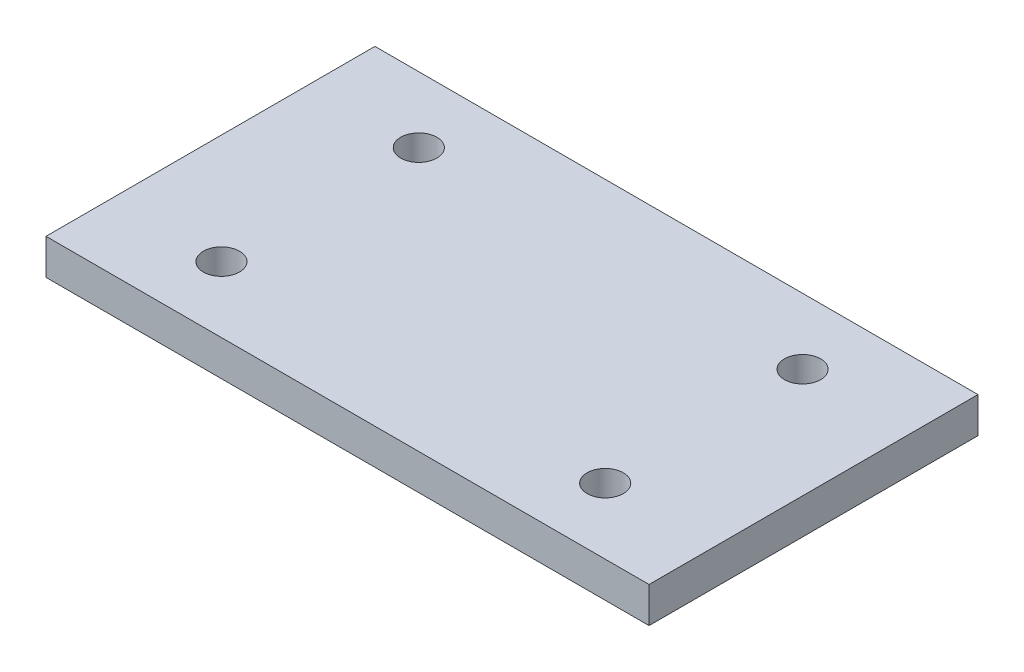
ISO-10303-21;
HEADER;
FILE_DESCRIPTION(('STEP AP214'),'2;1');
FILE_NAME('part.step','',(''),(''),'','','');
FILE_SCHEMA(('AUTOMOTIVE_DESIGN { 1 0 10303 214 1 1 1 1 }'));
ENDSEC;
DATA;
#1=APPLICATION_CONTEXT('core data for automotive mechanical design processes');
#2=APPLICATION_PROTOCOL_DEFINITION('international standard','automotive_design',2000,#1);
#3=PRODUCT_CONTEXT('',#1,'mechanical');
#4=PRODUCT('Part','Part','',(#3));
#5=PRODUCT_RELATED_PRODUCT_CATEGORY('part','',(#4));
#6=PRODUCT_DEFINITION_FORMATION('','',#4);
#7=PRODUCT_DEFINITION_CONTEXT('part definition',#1,'design');
#8=PRODUCT_DEFINITION('design','',#6,#7);
#9=PRODUCT_DEFINITION_SHAPE('','',#8);
#10=(LENGTH_UNIT() NAMED_UNIT(*) SI_UNIT(.MILLI.,.METRE.));
#11=(NAMED_UNIT(*) PLANE_ANGLE_UNIT() SI_UNIT($,.RADIAN.));
#12=(NAMED_UNIT(*) SI_UNIT($,.STERADIAN.) SOLID_ANGLE_UNIT());
#13=UNCERTAINTY_MEASURE_WITH_UNIT(LENGTH_MEASURE(1.E-05),#10,'distance_accuracy_value','');
#14=(GEOMETRIC_REPRESENTATION_CONTEXT(3) GLOBAL_UNCERTAINTY_ASSIGNED_CONTEXT((#13)) GLOBAL_UNIT_ASSIGNED_CONTEXT((#10,
#11,#12)) REPRESENTATION_CONTEXT('',''));
#15=CARTESIAN_POINT('',(0.,0.,0.));
#16=DIRECTION('',(0.,0.,1.));
#17=DIRECTION('',(1.,0.,0.));
#18=AXIS2_PLACEMENT_3D('',#15,#16,#17);
#19=CARTESIAN_POINT('',(0.,3.25,0.));
#20=DIRECTION('',(0.,-1.,0.));
#21=DIRECTION('',(0.,0.,-1.));
#22=AXIS2_PLACEMENT_3D('',#19,#20,#21);
#23=PLANE('',#22);
#24=DIRECTION('',(0.,0.,-1.));
#25=VECTOR('',#24,1.);
#26=CARTESIAN_POINT('',(27.5,3.25,15.));
#27=LINE('',#26,#25);
#28=CARTESIAN_POINT('',(27.5,3.25,15.));
#29=VERTEX_POINT('',#28);
#30=CARTESIAN_POINT('',(27.5,3.25,-15.));
#31=VERTEX_POINT('',#30);
#32=EDGE_CURVE('E96',#29,#31,#27,.T.);
#33=ORIENTED_EDGE('',*,*,#32,.T.);
#34=DIRECTION('',(-1.,0.,0.));
#35=VECTOR('',#34,1.);
#36=CARTESIAN_POINT('',(-27.5,3.25,-15.));
#37=LINE('',#36,#35);
#38=CARTESIAN_POINT('',(-27.5,3.25,-15.));
#39=VERTEX_POINT('',#38);
#40=EDGE_CURVE('E91',#31,#39,#37,.T.);
#41=ORIENTED_EDGE('',*,*,#40,.T.);
#42=DIRECTION('',(0.,0.,1.));
#43=VECTOR('',#42,1.);
#44=CARTESIAN_POINT('',(-27.5,3.25,15.));
#45=LINE('',#44,#43);
#46=CARTESIAN_POINT('',(-27.5,3.25,15.));
#47=VERTEX_POINT('',#46);
#48=EDGE_CURVE('E94',#39,#47,#45,.T.);
#49=ORIENTED_EDGE('',*,*,#48,.T.);
#50=DIRECTION('',(1.,0.,0.));
#51=VECTOR('',#50,1.);
#52=CARTESIAN_POINT('',(-27.5,3.25,15.));
#53=LINE('',#52,#51);
#54=EDGE_CURVE('E61',#47,#29,#53,.T.);
#55=ORIENTED_EDGE('',*,*,#54,.T.);
#56=EDGE_LOOP('',(#33,#41,#49,#55));
#57=FACE_BOUND('',#56,.T.);
#58=CARTESIAN_POINT('',(-17.5,3.25,-9.));
#59=DIRECTION('',(0.,1.,0.));
#60=DIRECTION('',(0.,0.,1.));
#61=AXIS2_PLACEMENT_3D('',#58,#59,#60);
#62=CIRCLE('',#61,1.65);
#63=CARTESIAN_POINT('',(-17.5,3.25,-7.35));
#64=VERTEX_POINT('',#63);
#65=EDGE_CURVE('E114',#64,#64,#62,.T.);
#66=ORIENTED_EDGE('',*,*,#65,.F.);
#67=EDGE_LOOP('',(#66));
#68=FACE_BOUND('',#67,.T.);
#69=CARTESIAN_POINT('',(17.5,3.25,-9.));
#70=DIRECTION('',(0.,1.,0.));
#71=DIRECTION('',(0.,0.,1.));
#72=AXIS2_PLACEMENT_3D('',#69,#70,#71);
#73=CIRCLE('',#72,1.65);
#74=CARTESIAN_POINT('',(17.5,3.25,-7.35));
#75=VERTEX_POINT('',#74);
#76=EDGE_CURVE('E134',#75,#75,#73,.T.);
#77=ORIENTED_EDGE('',*,*,#76,.F.);
#78=EDGE_LOOP('',(#77));
#79=FACE_BOUND('',#78,.T.);
#80=CARTESIAN_POINT('',(17.5,3.25,9.));
#81=DIRECTION('',(0.,1.,0.));
#82=DIRECTION('',(0.,0.,1.));
#83=AXIS2_PLACEMENT_3D('',#80,#81,#82);
#84=CIRCLE('',#83,1.65);
#85=CARTESIAN_POINT('',(17.5,3.25,10.65));
#86=VERTEX_POINT('',#85);
#87=EDGE_CURVE('E142',#86,#86,#84,.T.);
#88=ORIENTED_EDGE('',*,*,#87,.F.);
#89=EDGE_LOOP('',(#88));
#90=FACE_BOUND('',#89,.T.);
#91=CARTESIAN_POINT('',(-17.5,3.25,9.));
#92=DIRECTION('',(0.,1.,0.));
#93=DIRECTION('',(0.,0.,1.));
#94=AXIS2_PLACEMENT_3D('',#91,#92,#93);
#95=CIRCLE('',#94,1.65);
#96=CARTESIAN_POINT('',(-17.5,3.25,10.65));
#97=VERTEX_POINT('',#96);
#98=EDGE_CURVE('E149',#97,#97,#95,.T.);
#99=ORIENTED_EDGE('',*,*,#98,.F.);
#100=EDGE_LOOP('',(#99));
#101=FACE_BOUND('',#100,.T.);
#102=ADVANCED_FACE('F42',(#57,#68,#79,#90,#101),#23,.F.);
#103=CARTESIAN_POINT('',(0.,0.,0.));
#104=DIRECTION('',(0.,-1.,0.));
#105=DIRECTION('',(0.,0.,-1.));
#106=AXIS2_PLACEMENT_3D('',#103,#104,#105);
#107=PLANE('',#106);
#108=CARTESIAN_POINT('',(17.5,0.,9.));
#109=DIRECTION('',(0.,1.,0.));
#110=DIRECTION('',(0.,0.,1.));
#111=AXIS2_PLACEMENT_3D('',#108,#109,#110);
#112=CIRCLE('',#111,1.65);
#113=CARTESIAN_POINT('',(17.5,0.,10.65));
#114=VERTEX_POINT('',#113);
#115=EDGE_CURVE('E145',#114,#114,#112,.T.);
#116=ORIENTED_EDGE('',*,*,#115,.T.);
#117=EDGE_LOOP('',(#116));
#118=FACE_BOUND('',#117,.T.);
#119=CARTESIAN_POINT('',(-17.5,0.,-9.));
#120=DIRECTION('',(0.,1.,0.));
#121=DIRECTION('',(0.,0.,1.));
#122=AXIS2_PLACEMENT_3D('',#119,#120,#121);
#123=CIRCLE('',#122,1.65);
#124=CARTESIAN_POINT('',(-17.5,0.,-7.35));
#125=VERTEX_POINT('',#124);
#126=EDGE_CURVE('E130',#125,#125,#123,.T.);
#127=ORIENTED_EDGE('',*,*,#126,.T.);
#128=EDGE_LOOP('',(#127));
#129=FACE_BOUND('',#128,.T.);
#130=DIRECTION('',(0.,0.,-1.));
#131=VECTOR('',#130,1.);
#132=CARTESIAN_POINT('',(27.5,0.,15.));
#133=LINE('',#132,#131);
#134=CARTESIAN_POINT('',(27.5,0.,15.));
#135=VERTEX_POINT('',#134);
#136=CARTESIAN_POINT('',(27.5,0.,-15.));
#137=VERTEX_POINT('',#136);
#138=EDGE_CURVE('E110',#135,#137,#133,.T.);
#139=ORIENTED_EDGE('',*,*,#138,.F.);
#140=DIRECTION('',(1.,0.,0.));
#141=VECTOR('',#140,1.);
#142=CARTESIAN_POINT('',(-27.5,0.,15.));
#143=LINE('',#142,#141);
#144=CARTESIAN_POINT('',(-27.5,0.,15.));
#145=VERTEX_POINT('',#144);
#146=EDGE_CURVE('E84',#145,#135,#143,.T.);
#147=ORIENTED_EDGE('',*,*,#146,.F.);
#148=DIRECTION('',(0.,0.,1.));
#149=VECTOR('',#148,1.);
#150=CARTESIAN_POINT('',(-27.5,0.,15.));
#151=LINE('',#150,#149);
#152=CARTESIAN_POINT('',(-27.5,0.,-15.));
#153=VERTEX_POINT('',#152);
#154=EDGE_CURVE('E78',#153,#145,#151,.T.);
#155=ORIENTED_EDGE('',*,*,#154,.F.);
#156=DIRECTION('',(-1.,0.,0.));
#157=VECTOR('',#156,1.);
#158=CARTESIAN_POINT('',(-27.5,0.,-15.));
#159=LINE('',#158,#157);
#160=EDGE_CURVE('E101',#137,#153,#159,.T.);
#161=ORIENTED_EDGE('',*,*,#160,.F.);
#162=EDGE_LOOP('',(#139,#147,#155,#161));
#163=FACE_BOUND('',#162,.T.);
#164=CARTESIAN_POINT('',(17.5,0.,-9.));
#165=DIRECTION('',(0.,1.,0.));
#166=DIRECTION('',(0.,0.,1.));
#167=AXIS2_PLACEMENT_3D('',#164,#165,#166);
#168=CIRCLE('',#167,1.65);
#169=CARTESIAN_POINT('',(17.5,0.,-7.35));
#170=VERTEX_POINT('',#169);
#171=EDGE_CURVE('E138',#170,#170,#168,.T.);
#172=ORIENTED_EDGE('',*,*,#171,.T.);
#173=EDGE_LOOP('',(#172));
#174=FACE_BOUND('',#173,.T.);
#175=CARTESIAN_POINT('',(-17.5,0.,9.));
#176=DIRECTION('',(0.,1.,0.));
#177=DIRECTION('',(0.,0.,1.));
#178=AXIS2_PLACEMENT_3D('',#175,#176,#177);
#179=CIRCLE('',#178,1.65);
#180=CARTESIAN_POINT('',(-17.5,0.,10.65));
#181=VERTEX_POINT('',#180);
#182=EDGE_CURVE('E153',#181,#181,#179,.T.);
#183=ORIENTED_EDGE('',*,*,#182,.T.);
#184=EDGE_LOOP('',(#183));
#185=FACE_BOUND('',#184,.T.);
#186=ADVANCED_FACE('F125',(#118,#129,#163,#174,#185),#107,.T.);
#187=CARTESIAN_POINT('',(27.5,3.25,15.));
#188=DIRECTION('',(-1.,0.,0.));
#189=DIRECTION('',(0.,0.,1.));
#190=AXIS2_PLACEMENT_3D('',#187,#188,#189);
#191=PLANE('',#190);
#192=ORIENTED_EDGE('',*,*,#138,.T.);
#193=DIRECTION('',(0.,-1.,0.));
#194=VECTOR('',#193,1.);
#195=CARTESIAN_POINT('',(27.5,3.25,-15.));
#196=LINE('',#195,#194);
#197=EDGE_CURVE('E11',#31,#137,#196,.T.);
#198=ORIENTED_EDGE('',*,*,#197,.F.);
#199=ORIENTED_EDGE('',*,*,#32,.F.);
#200=DIRECTION('',(0.,-1.,0.));
#201=VECTOR('',#200,1.);
#202=CARTESIAN_POINT('',(27.5,3.25,15.));
#203=LINE('',#202,#201);
#204=EDGE_CURVE('E106',#29,#135,#203,.T.);
#205=ORIENTED_EDGE('',*,*,#204,.T.);
#206=EDGE_LOOP('',(#192,#198,#199,#205));
#207=FACE_BOUND('',#206,.T.);
#208=ADVANCED_FACE('F44',(#207),#191,.F.);
#209=CARTESIAN_POINT('',(-27.5,3.25,-15.));
#210=DIRECTION('',(0.,0.,1.));
#211=DIRECTION('',(1.,0.,0.));
#212=AXIS2_PLACEMENT_3D('',#209,#210,#211);
#213=PLANE('',#212);
#214=ORIENTED_EDGE('',*,*,#160,.T.);
#215=DIRECTION('',(0.,-1.,0.));
#216=VECTOR('',#215,1.);
#217=CARTESIAN_POINT('',(-27.5,3.25,-15.));
#218=LINE('',#217,#216);
#219=EDGE_CURVE('E51',#39,#153,#218,.T.);
#220=ORIENTED_EDGE('',*,*,#219,.F.);
#221=ORIENTED_EDGE('',*,*,#40,.F.);
#222=ORIENTED_EDGE('',*,*,#197,.T.);
#223=EDGE_LOOP('',(#214,#220,#221,#222));
#224=FACE_BOUND('',#223,.T.);
#225=ADVANCED_FACE('F100',(#224),#213,.F.);
#226=CARTESIAN_POINT('',(-27.5,3.25,15.));
#227=DIRECTION('',(1.,0.,0.));
#228=DIRECTION('',(0.,0.,-1.));
#229=AXIS2_PLACEMENT_3D('',#226,#227,#228);
#230=PLANE('',#229);
#231=ORIENTED_EDGE('',*,*,#154,.T.);
#232=DIRECTION('',(0.,-1.,0.));
#233=VECTOR('',#232,1.);
#234=CARTESIAN_POINT('',(-27.5,3.25,15.));
#235=LINE('',#234,#233);
#236=EDGE_CURVE('E102',#47,#145,#235,.T.);
#237=ORIENTED_EDGE('',*,*,#236,.F.);
#238=ORIENTED_EDGE('',*,*,#48,.F.);
#239=ORIENTED_EDGE('',*,*,#219,.T.);
#240=EDGE_LOOP('',(#231,#237,#238,#239));
#241=FACE_BOUND('',#240,.T.);
#242=ADVANCED_FACE('F103',(#241),#230,.F.);
#243=CARTESIAN_POINT('',(-27.5,3.25,15.));
#244=DIRECTION('',(0.,0.,-1.));
#245=DIRECTION('',(-1.,0.,0.));
#246=AXIS2_PLACEMENT_3D('',#243,#244,#245);
#247=PLANE('',#246);
#248=ORIENTED_EDGE('',*,*,#146,.T.);
#249=ORIENTED_EDGE('',*,*,#204,.F.);
#250=ORIENTED_EDGE('',*,*,#54,.F.);
#251=ORIENTED_EDGE('',*,*,#236,.T.);
#252=EDGE_LOOP('',(#248,#249,#250,#251));
#253=FACE_BOUND('',#252,.T.);
#254=ADVANCED_FACE('F122',(#253),#247,.F.);
#255=CARTESIAN_POINT('',(-17.5,3.25,-9.));
#256=DIRECTION('',(0.,-1.,0.));
#257=DIRECTION('',(0.,0.,-1.));
#258=AXIS2_PLACEMENT_3D('',#255,#256,#257);
#259=CYLINDRICAL_SURFACE('',#258,1.65);
#260=ORIENTED_EDGE('',*,*,#65,.T.);
#261=EDGE_LOOP('',(#260));
#262=FACE_BOUND('',#261,.T.);
#263=ORIENTED_EDGE('',*,*,#126,.F.);
#264=EDGE_LOOP('',(#263));
#265=FACE_BOUND('',#264,.T.);
#266=ADVANCED_FACE('F169',(#262,#265),#259,.F.);
#267=CARTESIAN_POINT('',(17.5,3.25,-9.));
#268=DIRECTION('',(0.,-1.,0.));
#269=DIRECTION('',(0.,0.,-1.));
#270=AXIS2_PLACEMENT_3D('',#267,#268,#269);
#271=CYLINDRICAL_SURFACE('',#270,1.65);
#272=ORIENTED_EDGE('',*,*,#76,.T.);
#273=EDGE_LOOP('',(#272));
#274=FACE_BOUND('',#273,.T.);
#275=ORIENTED_EDGE('',*,*,#171,.F.);
#276=EDGE_LOOP('',(#275));
#277=FACE_BOUND('',#276,.T.);
#278=ADVANCED_FACE('F232',(#274,#277),#271,.F.);
#279=CARTESIAN_POINT('',(17.5,3.25,9.));
#280=DIRECTION('',(0.,-1.,0.));
#281=DIRECTION('',(0.,0.,-1.));
#282=AXIS2_PLACEMENT_3D('',#279,#280,#281);
#283=CYLINDRICAL_SURFACE('',#282,1.65);
#284=ORIENTED_EDGE('',*,*,#87,.T.);
#285=EDGE_LOOP('',(#284));
#286=FACE_BOUND('',#285,.T.);
#287=ORIENTED_EDGE('',*,*,#115,.F.);
#288=EDGE_LOOP('',(#287));
#289=FACE_BOUND('',#288,.T.);
#290=ADVANCED_FACE('F242',(#286,#289),#283,.F.);
#291=CARTESIAN_POINT('',(-17.5,3.25,9.));
#292=DIRECTION('',(0.,-1.,0.));
#293=DIRECTION('',(0.,0.,-1.));
#294=AXIS2_PLACEMENT_3D('',#291,#292,#293);
#295=CYLINDRICAL_SURFACE('',#294,1.65);
#296=ORIENTED_EDGE('',*,*,#98,.T.);
#297=EDGE_LOOP('',(#296));
#298=FACE_BOUND('',#297,.T.);
#299=ORIENTED_EDGE('',*,*,#182,.F.);
#300=EDGE_LOOP('',(#299));
#301=FACE_BOUND('',#300,.T.);
#302=ADVANCED_FACE('F159',(#298,#301),#295,.F.);
#303=CLOSED_SHELL('',(#102,#186,#208,#225,#242,#254,#266,#278,#290,#302));
#304=MANIFOLD_SOLID_BREP('B2',#303);
#305=ADVANCED_BREP_SHAPE_REPRESENTATION('',(#18,#304),#14);
#306=SHAPE_DEFINITION_REPRESENTATION(#9,#305);
ENDSEC;
END-ISO-10303-21;
